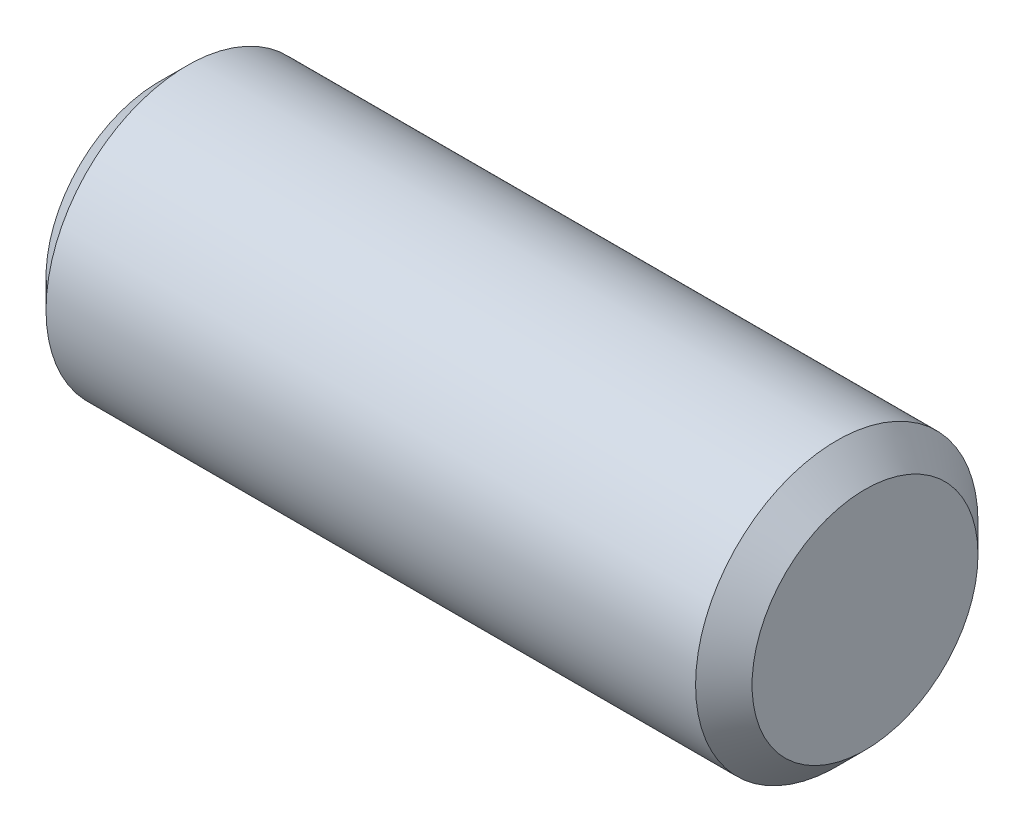
ISO-10303-21;
HEADER;
FILE_DESCRIPTION(('STEP AP214'),'2;1');
FILE_NAME('part.step','',(''),(''),'','','');
FILE_SCHEMA(('AUTOMOTIVE_DESIGN { 1 0 10303 214 1 1 1 1 }'));
ENDSEC;
DATA;
#1=APPLICATION_CONTEXT('core data for automotive mechanical design processes');
#2=APPLICATION_PROTOCOL_DEFINITION('international standard','automotive_design',2000,#1);
#3=PRODUCT_CONTEXT('',#1,'mechanical');
#4=PRODUCT('Part','Part','',(#3));
#5=PRODUCT_RELATED_PRODUCT_CATEGORY('part','',(#4));
#6=PRODUCT_DEFINITION_FORMATION('','',#4);
#7=PRODUCT_DEFINITION_CONTEXT('part definition',#1,'design');
#8=PRODUCT_DEFINITION('design','',#6,#7);
#9=PRODUCT_DEFINITION_SHAPE('','',#8);
#10=(LENGTH_UNIT() NAMED_UNIT(*) SI_UNIT(.MILLI.,.METRE.));
#11=(NAMED_UNIT(*) PLANE_ANGLE_UNIT() SI_UNIT($,.RADIAN.));
#12=(NAMED_UNIT(*) SI_UNIT($,.STERADIAN.) SOLID_ANGLE_UNIT());
#13=UNCERTAINTY_MEASURE_WITH_UNIT(LENGTH_MEASURE(1.E-05),#10,'distance_accuracy_value','');
#14=(GEOMETRIC_REPRESENTATION_CONTEXT(3) GLOBAL_UNCERTAINTY_ASSIGNED_CONTEXT((#13)) GLOBAL_UNIT_ASSIGNED_CONTEXT((#10,
#11,#12)) REPRESENTATION_CONTEXT('',''));
#15=CARTESIAN_POINT('',(0.,0.,0.));
#16=DIRECTION('',(0.,0.,1.));
#17=DIRECTION('',(1.,0.,0.));
#18=AXIS2_PLACEMENT_3D('',#15,#16,#17);
#19=CARTESIAN_POINT('',(-7.93750000000001,0.,0.));
#20=DIRECTION('',(1.,0.,0.));
#21=DIRECTION('',(0.,0.,-1.));
#22=AXIS2_PLACEMENT_3D('',#19,#20,#21);
#23=CYLINDRICAL_SURFACE('',#22,3.175);
#24=CARTESIAN_POINT('',(7.30249999999999,0.,0.));
#25=DIRECTION('',(1.,0.,0.));
#26=DIRECTION('',(0.,0.,-1.));
#27=AXIS2_PLACEMENT_3D('',#24,#25,#26);
#28=CIRCLE('',#27,3.175);
#29=CARTESIAN_POINT('',(7.30249999999999,0.,-3.175));
#30=VERTEX_POINT('',#29);
#31=EDGE_CURVE('E42',#30,#30,#28,.F.);
#32=ORIENTED_EDGE('',*,*,#31,.T.);
#33=EDGE_LOOP('',(#32));
#34=FACE_BOUND('',#33,.T.);
#35=CARTESIAN_POINT('',(-7.30249999999999,0.,0.));
#36=DIRECTION('',(1.,0.,0.));
#37=DIRECTION('',(0.,0.,-1.));
#38=AXIS2_PLACEMENT_3D('',#35,#36,#37);
#39=CIRCLE('',#38,3.175);
#40=CARTESIAN_POINT('',(-7.30249999999999,0.,-3.175));
#41=VERTEX_POINT('',#40);
#42=EDGE_CURVE('E46',#41,#41,#39,.T.);
#43=ORIENTED_EDGE('',*,*,#42,.T.);
#44=EDGE_LOOP('',(#43));
#45=FACE_BOUND('',#44,.T.);
#46=ADVANCED_FACE('F35',(#34,#45),#23,.T.);
#47=CARTESIAN_POINT('',(-7.93750000000001,0.,0.));
#48=DIRECTION('',(1.,0.,0.));
#49=DIRECTION('',(0.,0.,-1.));
#50=AXIS2_PLACEMENT_3D('',#47,#48,#49);
#51=PLANE('',#50);
#52=CARTESIAN_POINT('',(-7.93750000000001,0.,0.));
#53=DIRECTION('',(1.,0.,0.));
#54=DIRECTION('',(0.,0.,-1.));
#55=AXIS2_PLACEMENT_3D('',#52,#53,#54);
#56=CIRCLE('',#55,2.54);
#57=CARTESIAN_POINT('',(-7.93750000000001,0.,-2.54));
#58=VERTEX_POINT('',#57);
#59=EDGE_CURVE('E10',#58,#58,#56,.F.);
#60=ORIENTED_EDGE('',*,*,#59,.T.);
#61=EDGE_LOOP('',(#60));
#62=FACE_BOUND('',#61,.T.);
#63=ADVANCED_FACE('F66',(#62),#51,.F.);
#64=CARTESIAN_POINT('',(7.93750000000001,0.,0.));
#65=DIRECTION('',(1.,0.,0.));
#66=DIRECTION('',(0.,0.,-1.));
#67=AXIS2_PLACEMENT_3D('',#64,#65,#66);
#68=PLANE('',#67);
#69=CARTESIAN_POINT('',(7.93750000000001,0.,0.));
#70=DIRECTION('',(1.,0.,0.));
#71=DIRECTION('',(0.,0.,-1.));
#72=AXIS2_PLACEMENT_3D('',#69,#70,#71);
#73=CIRCLE('',#72,2.54);
#74=CARTESIAN_POINT('',(7.93750000000001,0.,-2.54));
#75=VERTEX_POINT('',#74);
#76=EDGE_CURVE('E50',#75,#75,#73,.T.);
#77=ORIENTED_EDGE('',*,*,#76,.T.);
#78=EDGE_LOOP('',(#77));
#79=FACE_BOUND('',#78,.T.);
#80=ADVANCED_FACE('F56',(#79),#68,.T.);
#81=CARTESIAN_POINT('',(7.93750000000001,0.,0.));
#82=DIRECTION('',(-1.,0.,0.));
#83=DIRECTION('',(0.,0.,1.));
#84=AXIS2_PLACEMENT_3D('',#81,#82,#83);
#85=CONICAL_SURFACE('',#84,2.54,0.785398163397448);
#86=ORIENTED_EDGE('',*,*,#31,.F.);
#87=EDGE_LOOP('',(#86));
#88=FACE_BOUND('',#87,.T.);
#89=ORIENTED_EDGE('',*,*,#76,.F.);
#90=EDGE_LOOP('',(#89));
#91=FACE_BOUND('',#90,.T.);
#92=ADVANCED_FACE('F58',(#88,#91),#85,.T.);
#93=CARTESIAN_POINT('',(-7.30249999999999,0.,0.));
#94=DIRECTION('',(1.,0.,0.));
#95=DIRECTION('',(0.,0.,-1.));
#96=AXIS2_PLACEMENT_3D('',#93,#94,#95);
#97=CONICAL_SURFACE('',#96,3.175,0.785398163397449);
#98=ORIENTED_EDGE('',*,*,#59,.F.);
#99=EDGE_LOOP('',(#98));
#100=FACE_BOUND('',#99,.T.);
#101=ORIENTED_EDGE('',*,*,#42,.F.);
#102=EDGE_LOOP('',(#101));
#103=FACE_BOUND('',#102,.T.);
#104=ADVANCED_FACE('F37',(#100,#103),#97,.T.);
#105=CLOSED_SHELL('',(#46,#63,#80,#92,#104));
#106=MANIFOLD_SOLID_BREP('B2',#105);
#107=ADVANCED_BREP_SHAPE_REPRESENTATION('',(#18,#106),#14);
#108=SHAPE_DEFINITION_REPRESENTATION(#9,#107);
ENDSEC;
END-ISO-10303-21;
